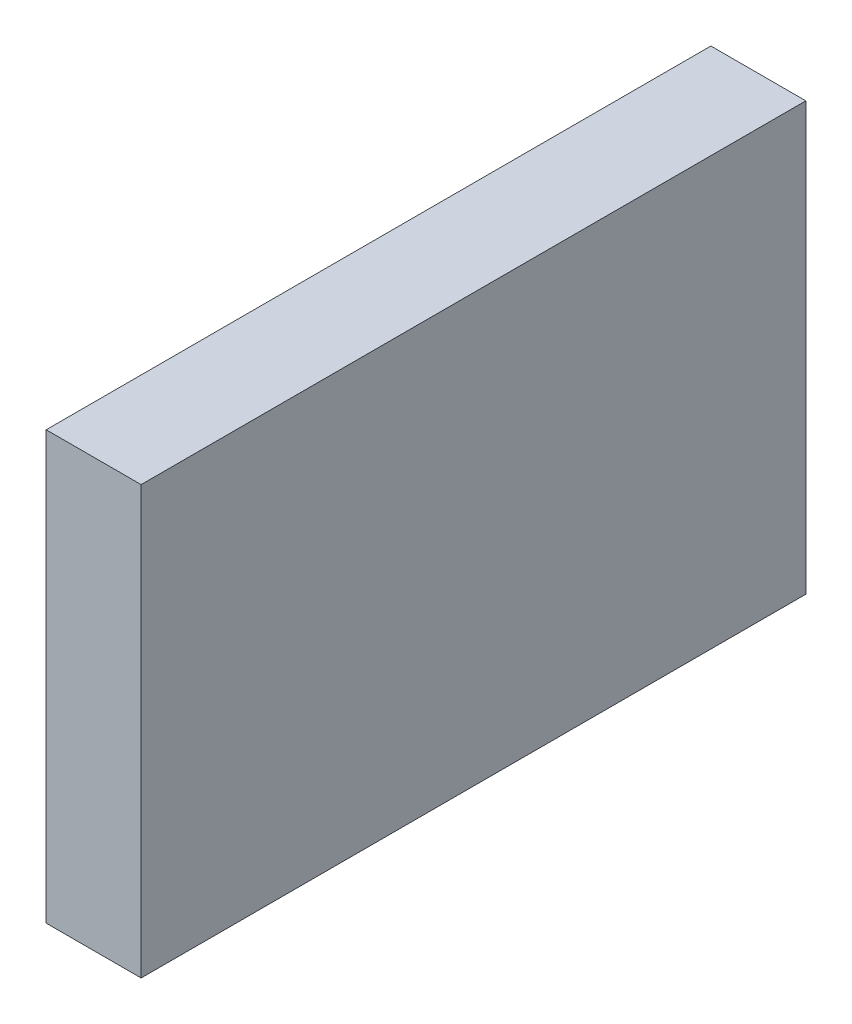
ISO-10303-21;
HEADER;
FILE_DESCRIPTION(('STEP AP214'),'2;1');
FILE_NAME('part.step','',(''),(''),'','','');
FILE_SCHEMA(('AUTOMOTIVE_DESIGN { 1 0 10303 214 1 1 1 1 }'));
ENDSEC;
DATA;
#1=APPLICATION_CONTEXT('core data for automotive mechanical design processes');
#2=APPLICATION_PROTOCOL_DEFINITION('international standard','automotive_design',2000,#1);
#3=PRODUCT_CONTEXT('',#1,'mechanical');
#4=PRODUCT('Part','Part','',(#3));
#5=PRODUCT_RELATED_PRODUCT_CATEGORY('part','',(#4));
#6=PRODUCT_DEFINITION_FORMATION('','',#4);
#7=PRODUCT_DEFINITION_CONTEXT('part definition',#1,'design');
#8=PRODUCT_DEFINITION('design','',#6,#7);
#9=PRODUCT_DEFINITION_SHAPE('','',#8);
#10=(LENGTH_UNIT() NAMED_UNIT(*) SI_UNIT(.MILLI.,.METRE.));
#11=(NAMED_UNIT(*) PLANE_ANGLE_UNIT() SI_UNIT($,.RADIAN.));
#12=(NAMED_UNIT(*) SI_UNIT($,.STERADIAN.) SOLID_ANGLE_UNIT());
#13=UNCERTAINTY_MEASURE_WITH_UNIT(LENGTH_MEASURE(1.E-05),#10,'distance_accuracy_value','');
#14=(GEOMETRIC_REPRESENTATION_CONTEXT(3) GLOBAL_UNCERTAINTY_ASSIGNED_CONTEXT((#13)) GLOBAL_UNIT_ASSIGNED_CONTEXT((#10,
#11,#12)) REPRESENTATION_CONTEXT('',''));
#15=CARTESIAN_POINT('',(0.,0.,0.));
#16=DIRECTION('',(0.,0.,1.));
#17=DIRECTION('',(1.,0.,0.));
#18=AXIS2_PLACEMENT_3D('',#15,#16,#17);
#19=CARTESIAN_POINT('',(1.,1.93168050722861,3.01866022572294));
#20=DIRECTION('',(0.,0.,-1.));
#21=DIRECTION('',(-1.,0.,0.));
#22=AXIS2_PLACEMENT_3D('',#19,#20,#21);
#23=PLANE('',#22);
#24=DIRECTION('',(0.,-1.,0.));
#25=VECTOR('',#24,1.);
#26=CARTESIAN_POINT('',(0.,1.93168050722861,3.01866022572294));
#27=LINE('',#26,#25);
#28=CARTESIAN_POINT('',(0.,1.93168050722861,3.01866022572294));
#29=VERTEX_POINT('',#28);
#30=CARTESIAN_POINT('',(0.,-2.56831949277139,3.01866022572294));
#31=VERTEX_POINT('',#30);
#32=EDGE_CURVE('E98',#29,#31,#27,.T.);
#33=ORIENTED_EDGE('',*,*,#32,.T.);
#34=DIRECTION('',(-1.,0.,0.));
#35=VECTOR('',#34,1.);
#36=CARTESIAN_POINT('',(1.,-2.56831949277139,3.01866022572294));
#37=LINE('',#36,#35);
#38=CARTESIAN_POINT('',(1.,-2.56831949277139,3.01866022572294));
#39=VERTEX_POINT('',#38);
#40=EDGE_CURVE('E11',#39,#31,#37,.T.);
#41=ORIENTED_EDGE('',*,*,#40,.F.);
#42=DIRECTION('',(0.,-1.,0.));
#43=VECTOR('',#42,1.);
#44=CARTESIAN_POINT('',(1.,1.93168050722861,3.01866022572294));
#45=LINE('',#44,#43);
#46=CARTESIAN_POINT('',(1.,1.93168050722861,3.01866022572294));
#47=VERTEX_POINT('',#46);
#48=EDGE_CURVE('E86',#47,#39,#45,.T.);
#49=ORIENTED_EDGE('',*,*,#48,.F.);
#50=DIRECTION('',(-1.,0.,0.));
#51=VECTOR('',#50,1.);
#52=CARTESIAN_POINT('',(1.,1.93168050722861,3.01866022572294));
#53=LINE('',#52,#51);
#54=EDGE_CURVE('E94',#47,#29,#53,.T.);
#55=ORIENTED_EDGE('',*,*,#54,.T.);
#56=EDGE_LOOP('',(#33,#41,#49,#55));
#57=FACE_BOUND('',#56,.T.);
#58=ADVANCED_FACE('F35',(#57),#23,.F.);
#59=CARTESIAN_POINT('',(1.,-2.56831949277139,3.01866022572294));
#60=DIRECTION('',(0.,1.,0.));
#61=DIRECTION('',(0.,0.,1.));
#62=AXIS2_PLACEMENT_3D('',#59,#60,#61);
#63=PLANE('',#62);
#64=DIRECTION('',(0.,0.,-1.));
#65=VECTOR('',#64,1.);
#66=CARTESIAN_POINT('',(0.,-2.56831949277139,3.01866022572294));
#67=LINE('',#66,#65);
#68=CARTESIAN_POINT('',(0.,-2.56831949277139,-3.98133977427706));
#69=VERTEX_POINT('',#68);
#70=EDGE_CURVE('E90',#31,#69,#67,.T.);
#71=ORIENTED_EDGE('',*,*,#70,.T.);
#72=DIRECTION('',(-1.,0.,0.));
#73=VECTOR('',#72,1.);
#74=CARTESIAN_POINT('',(1.,-2.56831949277139,-3.98133977427706));
#75=LINE('',#74,#73);
#76=CARTESIAN_POINT('',(1.,-2.56831949277139,-3.98133977427706));
#77=VERTEX_POINT('',#76);
#78=EDGE_CURVE('E43',#77,#69,#75,.T.);
#79=ORIENTED_EDGE('',*,*,#78,.F.);
#80=DIRECTION('',(0.,0.,-1.));
#81=VECTOR('',#80,1.);
#82=CARTESIAN_POINT('',(1.,-2.56831949277139,3.01866022572294));
#83=LINE('',#82,#81);
#84=EDGE_CURVE('E81',#39,#77,#83,.T.);
#85=ORIENTED_EDGE('',*,*,#84,.F.);
#86=ORIENTED_EDGE('',*,*,#40,.T.);
#87=EDGE_LOOP('',(#71,#79,#85,#86));
#88=FACE_BOUND('',#87,.T.);
#89=ADVANCED_FACE('F89',(#88),#63,.F.);
#90=CARTESIAN_POINT('',(1.,1.93168050722861,-3.98133977427706));
#91=DIRECTION('',(0.,0.,1.));
#92=DIRECTION('',(0.,-1.,0.));
#93=AXIS2_PLACEMENT_3D('',#90,#91,#92);
#94=PLANE('',#93);
#95=DIRECTION('',(0.,1.,0.));
#96=VECTOR('',#95,1.);
#97=CARTESIAN_POINT('',(0.,1.93168050722861,-3.98133977427706));
#98=LINE('',#97,#96);
#99=CARTESIAN_POINT('',(0.,1.93168050722861,-3.98133977427706));
#100=VERTEX_POINT('',#99);
#101=EDGE_CURVE('E68',#69,#100,#98,.T.);
#102=ORIENTED_EDGE('',*,*,#101,.T.);
#103=DIRECTION('',(-1.,0.,0.));
#104=VECTOR('',#103,1.);
#105=CARTESIAN_POINT('',(1.,1.93168050722861,-3.98133977427706));
#106=LINE('',#105,#104);
#107=CARTESIAN_POINT('',(1.,1.93168050722861,-3.98133977427706));
#108=VERTEX_POINT('',#107);
#109=EDGE_CURVE('E91',#108,#100,#106,.T.);
#110=ORIENTED_EDGE('',*,*,#109,.F.);
#111=DIRECTION('',(0.,1.,0.));
#112=VECTOR('',#111,1.);
#113=CARTESIAN_POINT('',(1.,1.93168050722861,-3.98133977427706));
#114=LINE('',#113,#112);
#115=EDGE_CURVE('E84',#77,#108,#114,.T.);
#116=ORIENTED_EDGE('',*,*,#115,.F.);
#117=ORIENTED_EDGE('',*,*,#78,.T.);
#118=EDGE_LOOP('',(#102,#110,#116,#117));
#119=FACE_BOUND('',#118,.T.);
#120=ADVANCED_FACE('F92',(#119),#94,.F.);
#121=CARTESIAN_POINT('',(1.,1.93168050722861,3.01866022572294));
#122=DIRECTION('',(0.,-1.,0.));
#123=DIRECTION('',(0.,0.,-1.));
#124=AXIS2_PLACEMENT_3D('',#121,#122,#123);
#125=PLANE('',#124);
#126=DIRECTION('',(0.,0.,1.));
#127=VECTOR('',#126,1.);
#128=CARTESIAN_POINT('',(0.,1.93168050722861,3.01866022572294));
#129=LINE('',#128,#127);
#130=EDGE_CURVE('E74',#100,#29,#129,.T.);
#131=ORIENTED_EDGE('',*,*,#130,.T.);
#132=ORIENTED_EDGE('',*,*,#54,.F.);
#133=DIRECTION('',(0.,0.,1.));
#134=VECTOR('',#133,1.);
#135=CARTESIAN_POINT('',(1.,1.93168050722861,3.01866022572294));
#136=LINE('',#135,#134);
#137=EDGE_CURVE('E51',#108,#47,#136,.T.);
#138=ORIENTED_EDGE('',*,*,#137,.F.);
#139=ORIENTED_EDGE('',*,*,#109,.T.);
#140=EDGE_LOOP('',(#131,#132,#138,#139));
#141=FACE_BOUND('',#140,.T.);
#142=ADVANCED_FACE('F105',(#141),#125,.F.);
#143=CARTESIAN_POINT('',(1.,0.,0.));
#144=DIRECTION('',(1.,0.,0.));
#145=DIRECTION('',(0.,0.,-1.));
#146=AXIS2_PLACEMENT_3D('',#143,#144,#145);
#147=PLANE('',#146);
#148=ORIENTED_EDGE('',*,*,#48,.T.);
#149=ORIENTED_EDGE('',*,*,#84,.T.);
#150=ORIENTED_EDGE('',*,*,#115,.T.);
#151=ORIENTED_EDGE('',*,*,#137,.T.);
#152=EDGE_LOOP('',(#148,#149,#150,#151));
#153=FACE_BOUND('',#152,.T.);
#154=ADVANCED_FACE('F82',(#153),#147,.T.);
#155=CARTESIAN_POINT('',(0.,0.,0.));
#156=DIRECTION('',(1.,0.,0.));
#157=DIRECTION('',(0.,0.,-1.));
#158=AXIS2_PLACEMENT_3D('',#155,#156,#157);
#159=PLANE('',#158);
#160=ORIENTED_EDGE('',*,*,#32,.F.);
#161=ORIENTED_EDGE('',*,*,#130,.F.);
#162=ORIENTED_EDGE('',*,*,#101,.F.);
#163=ORIENTED_EDGE('',*,*,#70,.F.);
#164=EDGE_LOOP('',(#160,#161,#162,#163));
#165=FACE_BOUND('',#164,.T.);
#166=ADVANCED_FACE('F108',(#165),#159,.F.);
#167=CLOSED_SHELL('',(#58,#89,#120,#142,#154,#166));
#168=MANIFOLD_SOLID_BREP('B2',#167);
#169=ADVANCED_BREP_SHAPE_REPRESENTATION('',(#18,#168),#14);
#170=SHAPE_DEFINITION_REPRESENTATION(#9,#169);
ENDSEC;
END-ISO-10303-21;
